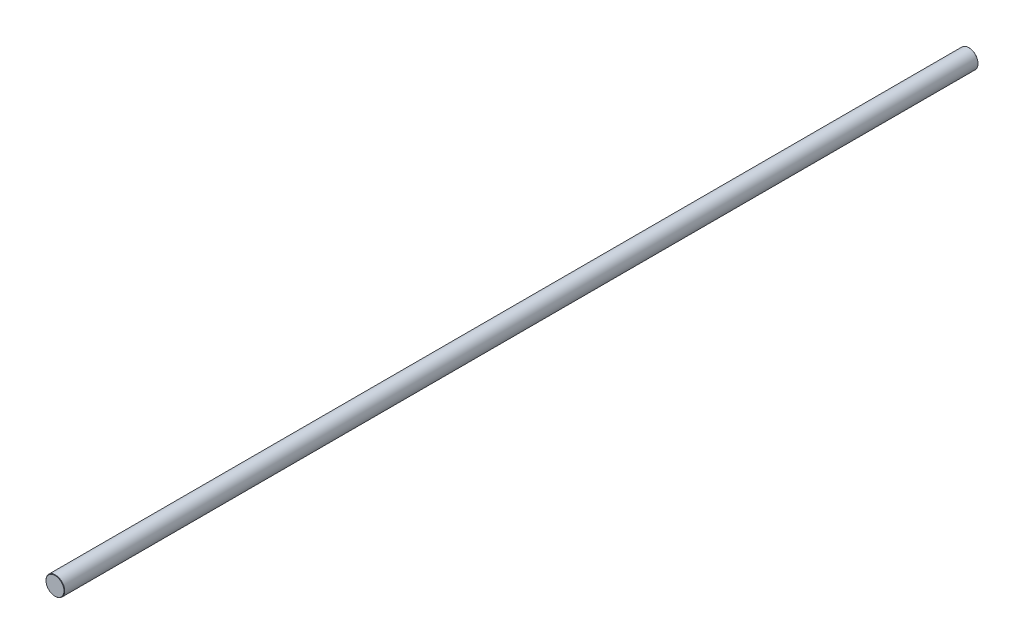
ISO-10303-21;
HEADER;
FILE_DESCRIPTION(('STEP AP214'),'2;1');
FILE_NAME('part.step','',(''),(''),'','','');
FILE_SCHEMA(('AUTOMOTIVE_DESIGN { 1 0 10303 214 1 1 1 1 }'));
ENDSEC;
DATA;
#1=APPLICATION_CONTEXT('core data for automotive mechanical design processes');
#2=APPLICATION_PROTOCOL_DEFINITION('international standard','automotive_design',2000,#1);
#3=PRODUCT_CONTEXT('',#1,'mechanical');
#4=PRODUCT('Part','Part','',(#3));
#5=PRODUCT_RELATED_PRODUCT_CATEGORY('part','',(#4));
#6=PRODUCT_DEFINITION_FORMATION('','',#4);
#7=PRODUCT_DEFINITION_CONTEXT('part definition',#1,'design');
#8=PRODUCT_DEFINITION('design','',#6,#7);
#9=PRODUCT_DEFINITION_SHAPE('','',#8);
#10=(LENGTH_UNIT() NAMED_UNIT(*) SI_UNIT(.MILLI.,.METRE.));
#11=(NAMED_UNIT(*) PLANE_ANGLE_UNIT() SI_UNIT($,.RADIAN.));
#12=(NAMED_UNIT(*) SI_UNIT($,.STERADIAN.) SOLID_ANGLE_UNIT());
#13=UNCERTAINTY_MEASURE_WITH_UNIT(LENGTH_MEASURE(1.E-05),#10,'distance_accuracy_value','');
#14=(GEOMETRIC_REPRESENTATION_CONTEXT(3) GLOBAL_UNCERTAINTY_ASSIGNED_CONTEXT((#13)) GLOBAL_UNIT_ASSIGNED_CONTEXT((#10,
#11,#12)) REPRESENTATION_CONTEXT('',''));
#15=CARTESIAN_POINT('',(0.,0.,0.));
#16=DIRECTION('',(0.,0.,1.));
#17=DIRECTION('',(1.,0.,0.));
#18=AXIS2_PLACEMENT_3D('',#15,#16,#17);
#19=CARTESIAN_POINT('',(0.,0.,610.));
#20=DIRECTION('',(0.,0.,-1.));
#21=DIRECTION('',(-1.,0.,0.));
#22=AXIS2_PLACEMENT_3D('',#19,#20,#21);
#23=CYLINDRICAL_SURFACE('',#22,12.5);
#24=CARTESIAN_POINT('',(0.,0.,-609.5));
#25=DIRECTION('',(0.,0.,1.));
#26=DIRECTION('',(1.,0.,0.));
#27=AXIS2_PLACEMENT_3D('',#24,#25,#26);
#28=CIRCLE('',#27,12.5);
#29=CARTESIAN_POINT('',(12.5,0.,-609.5));
#30=VERTEX_POINT('',#29);
#31=EDGE_CURVE('E56',#30,#30,#28,.T.);
#32=ORIENTED_EDGE('',*,*,#31,.T.);
#33=EDGE_LOOP('',(#32));
#34=FACE_BOUND('',#33,.T.);
#35=CARTESIAN_POINT('',(0.,0.,609.5));
#36=DIRECTION('',(0.,0.,1.));
#37=DIRECTION('',(1.,0.,0.));
#38=AXIS2_PLACEMENT_3D('',#35,#36,#37);
#39=CIRCLE('',#38,12.5);
#40=CARTESIAN_POINT('',(12.5,0.,609.5));
#41=VERTEX_POINT('',#40);
#42=EDGE_CURVE('E61',#41,#41,#39,.F.);
#43=ORIENTED_EDGE('',*,*,#42,.T.);
#44=EDGE_LOOP('',(#43));
#45=FACE_BOUND('',#44,.T.);
#46=ADVANCED_FACE('F43',(#34,#45),#23,.T.);
#47=CARTESIAN_POINT('',(0.,0.,610.));
#48=DIRECTION('',(0.,0.,1.));
#49=DIRECTION('',(1.,0.,0.));
#50=AXIS2_PLACEMENT_3D('',#47,#48,#49);
#51=PLANE('',#50);
#52=CARTESIAN_POINT('',(0.,0.,610.));
#53=DIRECTION('',(0.,0.,1.));
#54=DIRECTION('',(1.,0.,0.));
#55=AXIS2_PLACEMENT_3D('',#52,#53,#54);
#56=CIRCLE('',#55,11.9999999999998);
#57=CARTESIAN_POINT('',(11.9999999999998,0.,610.));
#58=VERTEX_POINT('',#57);
#59=EDGE_CURVE('E10',#58,#58,#56,.T.);
#60=ORIENTED_EDGE('',*,*,#59,.T.);
#61=EDGE_LOOP('',(#60));
#62=FACE_BOUND('',#61,.T.);
#63=ADVANCED_FACE('F78',(#62),#51,.T.);
#64=CARTESIAN_POINT('',(0.,0.,-610.));
#65=DIRECTION('',(0.,0.,1.));
#66=DIRECTION('',(1.,0.,0.));
#67=AXIS2_PLACEMENT_3D('',#64,#65,#66);
#68=PLANE('',#67);
#69=CARTESIAN_POINT('',(0.,0.,-610.));
#70=DIRECTION('',(0.,0.,1.));
#71=DIRECTION('',(1.,0.,0.));
#72=AXIS2_PLACEMENT_3D('',#69,#70,#71);
#73=CIRCLE('',#72,12.);
#74=CARTESIAN_POINT('',(12.,0.,-610.));
#75=VERTEX_POINT('',#74);
#76=EDGE_CURVE('E51',#75,#75,#73,.F.);
#77=ORIENTED_EDGE('',*,*,#76,.T.);
#78=EDGE_LOOP('',(#77));
#79=FACE_BOUND('',#78,.T.);
#80=ADVANCED_FACE('F75',(#79),#68,.F.);
#81=CARTESIAN_POINT('',(0.,0.,-609.5));
#82=DIRECTION('',(0.,0.,1.));
#83=DIRECTION('',(1.,0.,0.));
#84=AXIS2_PLACEMENT_3D('',#81,#82,#83);
#85=CONICAL_SURFACE('',#84,12.5,0.785398163397493);
#86=ORIENTED_EDGE('',*,*,#76,.F.);
#87=EDGE_LOOP('',(#86));
#88=FACE_BOUND('',#87,.T.);
#89=ORIENTED_EDGE('',*,*,#31,.F.);
#90=EDGE_LOOP('',(#89));
#91=FACE_BOUND('',#90,.T.);
#92=ADVANCED_FACE('F71',(#88,#91),#85,.T.);
#93=CARTESIAN_POINT('',(0.,0.,610.));
#94=DIRECTION('',(0.,0.,-1.));
#95=DIRECTION('',(-1.,0.,0.));
#96=AXIS2_PLACEMENT_3D('',#93,#94,#95);
#97=CONICAL_SURFACE('',#96,11.9999999999998,0.785398163397382);
#98=ORIENTED_EDGE('',*,*,#42,.F.);
#99=EDGE_LOOP('',(#98));
#100=FACE_BOUND('',#99,.T.);
#101=ORIENTED_EDGE('',*,*,#59,.F.);
#102=EDGE_LOOP('',(#101));
#103=FACE_BOUND('',#102,.T.);
#104=ADVANCED_FACE('F45',(#100,#103),#97,.T.);
#105=CLOSED_SHELL('',(#46,#63,#80,#92,#104));
#106=MANIFOLD_SOLID_BREP('B2',#105);
#107=ADVANCED_BREP_SHAPE_REPRESENTATION('',(#18,#106),#14);
#108=SHAPE_DEFINITION_REPRESENTATION(#9,#107);
ENDSEC;
END-ISO-10303-21;
